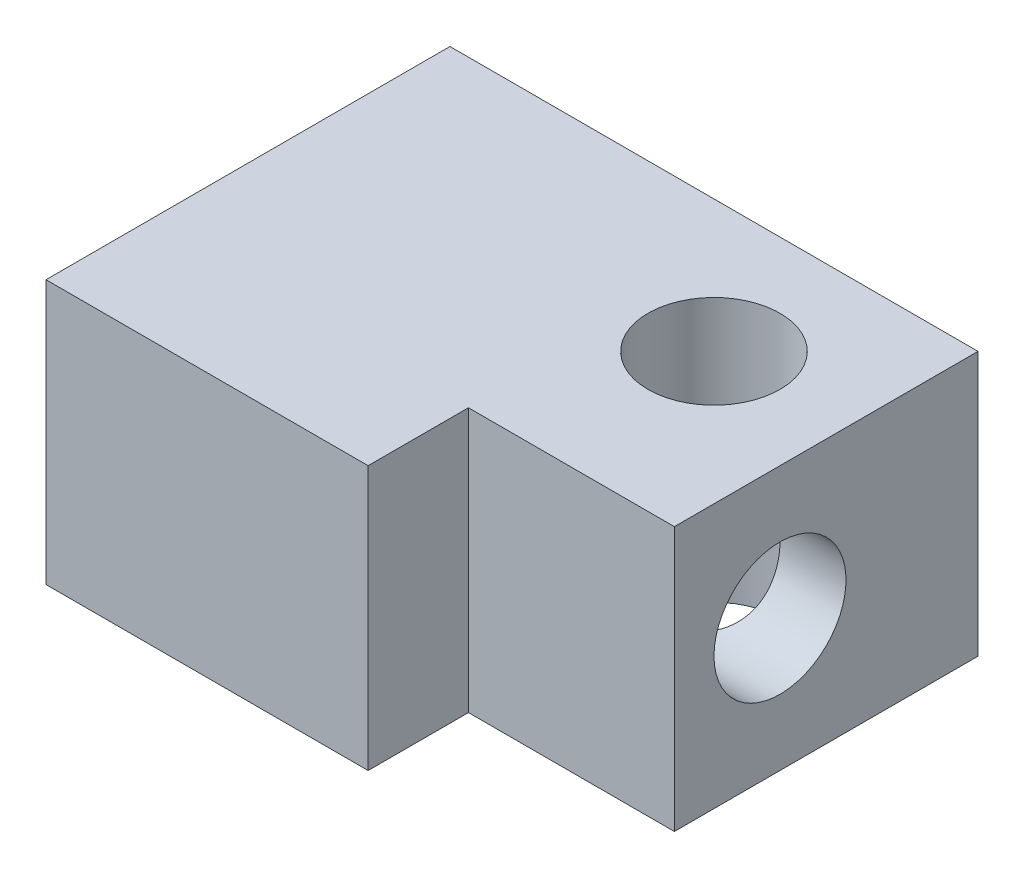
ISO-10303-21;
HEADER;
FILE_DESCRIPTION(('STEP AP214'),'2;1');
FILE_NAME('part.step','',(''),(''),'','','');
FILE_SCHEMA(('AUTOMOTIVE_DESIGN { 1 0 10303 214 1 1 1 1 }'));
ENDSEC;
DATA;
#1=APPLICATION_CONTEXT('core data for automotive mechanical design processes');
#2=APPLICATION_PROTOCOL_DEFINITION('international standard','automotive_design',2000,#1);
#3=PRODUCT_CONTEXT('',#1,'mechanical');
#4=PRODUCT('Part','Part','',(#3));
#5=PRODUCT_RELATED_PRODUCT_CATEGORY('part','',(#4));
#6=PRODUCT_DEFINITION_FORMATION('','',#4);
#7=PRODUCT_DEFINITION_CONTEXT('part definition',#1,'design');
#8=PRODUCT_DEFINITION('design','',#6,#7);
#9=PRODUCT_DEFINITION_SHAPE('','',#8);
#10=(LENGTH_UNIT() NAMED_UNIT(*) SI_UNIT(.MILLI.,.METRE.));
#11=(NAMED_UNIT(*) PLANE_ANGLE_UNIT() SI_UNIT($,.RADIAN.));
#12=(NAMED_UNIT(*) SI_UNIT($,.STERADIAN.) SOLID_ANGLE_UNIT());
#13=UNCERTAINTY_MEASURE_WITH_UNIT(LENGTH_MEASURE(1.E-05),#10,'distance_accuracy_value','');
#14=(GEOMETRIC_REPRESENTATION_CONTEXT(3) GLOBAL_UNCERTAINTY_ASSIGNED_CONTEXT((#13)) GLOBAL_UNIT_ASSIGNED_CONTEXT((#10,
#11,#12)) REPRESENTATION_CONTEXT('',''));
#15=CARTESIAN_POINT('',(0.,0.,0.));
#16=DIRECTION('',(0.,0.,1.));
#17=DIRECTION('',(1.,0.,0.));
#18=AXIS2_PLACEMENT_3D('',#15,#16,#17);
#19=CARTESIAN_POINT('',(0.,5.,8.24999999999998));
#20=DIRECTION('',(0.,0.,1.));
#21=DIRECTION('',(1.,0.,0.));
#22=AXIS2_PLACEMENT_3D('',#19,#20,#21);
#23=PLANE('',#22);
#24=DIRECTION('',(-1.,0.,0.));
#25=VECTOR('',#24,1.);
#26=CARTESIAN_POINT('',(0.,0.,8.24999999999998));
#27=LINE('',#26,#25);
#28=CARTESIAN_POINT('',(7.50000000000001,0.,8.24999999999998));
#29=VERTEX_POINT('',#28);
#30=CARTESIAN_POINT('',(3.60000000000001,0.,8.24999999999998));
#31=VERTEX_POINT('',#30);
#32=EDGE_CURVE('E127',#29,#31,#27,.T.);
#33=ORIENTED_EDGE('',*,*,#32,.F.);
#34=DIRECTION('',(0.,-1.,0.));
#35=VECTOR('',#34,1.);
#36=CARTESIAN_POINT('',(7.50000000000001,5.,8.24999999999998));
#37=LINE('',#36,#35);
#38=CARTESIAN_POINT('',(7.50000000000001,5.,8.24999999999998));
#39=VERTEX_POINT('',#38);
#40=EDGE_CURVE('E11',#39,#29,#37,.T.);
#41=ORIENTED_EDGE('',*,*,#40,.F.);
#42=DIRECTION('',(-1.,0.,0.));
#43=VECTOR('',#42,1.);
#44=CARTESIAN_POINT('',(0.,5.,8.24999999999998));
#45=LINE('',#44,#43);
#46=CARTESIAN_POINT('',(3.60000000000001,5.,8.24999999999998));
#47=VERTEX_POINT('',#46);
#48=EDGE_CURVE('E197',#39,#47,#45,.T.);
#49=ORIENTED_EDGE('',*,*,#48,.T.);
#50=DIRECTION('',(0.,-1.,0.));
#51=VECTOR('',#50,1.);
#52=CARTESIAN_POINT('',(3.60000000000001,5.,8.24999999999998));
#53=LINE('',#52,#51);
#54=EDGE_CURVE('E87',#47,#31,#53,.T.);
#55=ORIENTED_EDGE('',*,*,#54,.T.);
#56=EDGE_LOOP('',(#33,#41,#49,#55));
#57=FACE_BOUND('',#56,.T.);
#58=ADVANCED_FACE('F36',(#57),#23,.T.);
#59=CARTESIAN_POINT('',(7.50000000000001,5.,0.));
#60=DIRECTION('',(-1.,0.,0.));
#61=DIRECTION('',(0.,0.,1.));
#62=AXIS2_PLACEMENT_3D('',#59,#60,#61);
#63=PLANE('',#62);
#64=CARTESIAN_POINT('',(7.50000000000001,2.5,6.24999999999997));
#65=DIRECTION('',(-1.,0.,0.));
#66=DIRECTION('',(0.,0.,1.));
#67=AXIS2_PLACEMENT_3D('',#64,#65,#66);
#68=CIRCLE('',#67,1.25);
#69=CARTESIAN_POINT('',(7.50000000000001,2.5,7.49999999999997));
#70=VERTEX_POINT('',#69);
#71=EDGE_CURVE('E188',#70,#70,#68,.T.);
#72=ORIENTED_EDGE('',*,*,#71,.T.);
#73=EDGE_LOOP('',(#72));
#74=FACE_BOUND('',#73,.T.);
#75=DIRECTION('',(0.,0.,-1.));
#76=VECTOR('',#75,1.);
#77=CARTESIAN_POINT('',(7.50000000000001,0.,0.));
#78=LINE('',#77,#76);
#79=CARTESIAN_POINT('',(7.50000000000001,0.,2.49999999999997));
#80=VERTEX_POINT('',#79);
#81=EDGE_CURVE('E130',#29,#80,#78,.T.);
#82=ORIENTED_EDGE('',*,*,#81,.T.);
#83=DIRECTION('',(0.,-1.,0.));
#84=VECTOR('',#83,1.);
#85=CARTESIAN_POINT('',(7.50000000000001,5.,2.49999999999997));
#86=LINE('',#85,#84);
#87=CARTESIAN_POINT('',(7.50000000000001,5.,2.49999999999997));
#88=VERTEX_POINT('',#87);
#89=EDGE_CURVE('E51',#88,#80,#86,.T.);
#90=ORIENTED_EDGE('',*,*,#89,.F.);
#91=DIRECTION('',(0.,0.,-1.));
#92=VECTOR('',#91,1.);
#93=CARTESIAN_POINT('',(7.50000000000001,5.,0.));
#94=LINE('',#93,#92);
#95=EDGE_CURVE('E199',#39,#88,#94,.T.);
#96=ORIENTED_EDGE('',*,*,#95,.F.);
#97=ORIENTED_EDGE('',*,*,#40,.T.);
#98=EDGE_LOOP('',(#82,#90,#96,#97));
#99=FACE_BOUND('',#98,.T.);
#100=ADVANCED_FACE('F151',(#74,#99),#63,.F.);
#101=CARTESIAN_POINT('',(0.,5.,2.49999999999997));
#102=DIRECTION('',(0.,0.,1.));
#103=DIRECTION('',(1.,0.,0.));
#104=AXIS2_PLACEMENT_3D('',#101,#102,#103);
#105=PLANE('',#104);
#106=DIRECTION('',(-1.,0.,0.));
#107=VECTOR('',#106,1.);
#108=CARTESIAN_POINT('',(0.,0.,2.49999999999997));
#109=LINE('',#108,#107);
#110=CARTESIAN_POINT('',(-2.49999999999999,0.,2.49999999999997));
#111=VERTEX_POINT('',#110);
#112=EDGE_CURVE('E133',#80,#111,#109,.T.);
#113=ORIENTED_EDGE('',*,*,#112,.T.);
#114=DIRECTION('',(0.,-1.,0.));
#115=VECTOR('',#114,1.);
#116=CARTESIAN_POINT('',(-2.49999999999999,5.,2.49999999999997));
#117=LINE('',#116,#115);
#118=CARTESIAN_POINT('',(-2.49999999999999,5.,2.49999999999997));
#119=VERTEX_POINT('',#118);
#120=EDGE_CURVE('E117',#119,#111,#117,.T.);
#121=ORIENTED_EDGE('',*,*,#120,.F.);
#122=DIRECTION('',(-1.,0.,0.));
#123=VECTOR('',#122,1.);
#124=CARTESIAN_POINT('',(0.,5.,2.49999999999997));
#125=LINE('',#124,#123);
#126=EDGE_CURVE('E105',#88,#119,#125,.T.);
#127=ORIENTED_EDGE('',*,*,#126,.F.);
#128=ORIENTED_EDGE('',*,*,#89,.T.);
#129=EDGE_LOOP('',(#113,#121,#127,#128));
#130=FACE_BOUND('',#129,.T.);
#131=ADVANCED_FACE('F148',(#130),#105,.F.);
#132=CARTESIAN_POINT('',(-2.49999999999999,5.,0.));
#133=DIRECTION('',(1.,0.,0.));
#134=DIRECTION('',(0.,0.,-1.));
#135=AXIS2_PLACEMENT_3D('',#132,#133,#134);
#136=PLANE('',#135);
#137=CARTESIAN_POINT('',(-2.49999999999999,2.5,6.24999999999997));
#138=DIRECTION('',(-1.,0.,0.));
#139=DIRECTION('',(0.,0.,1.));
#140=AXIS2_PLACEMENT_3D('',#137,#138,#139);
#141=CIRCLE('',#140,1.25);
#142=CARTESIAN_POINT('',(-2.49999999999999,2.5,7.49999999999997));
#143=VERTEX_POINT('',#142);
#144=EDGE_CURVE('E191',#143,#143,#141,.T.);
#145=ORIENTED_EDGE('',*,*,#144,.F.);
#146=EDGE_LOOP('',(#145));
#147=FACE_BOUND('',#146,.T.);
#148=DIRECTION('',(0.,0.,1.));
#149=VECTOR('',#148,1.);
#150=CARTESIAN_POINT('',(-2.49999999999999,0.,0.));
#151=LINE('',#150,#149);
#152=CARTESIAN_POINT('',(-2.49999999999999,0.,10.15));
#153=VERTEX_POINT('',#152);
#154=EDGE_CURVE('E113',#111,#153,#151,.T.);
#155=ORIENTED_EDGE('',*,*,#154,.T.);
#156=DIRECTION('',(0.,-1.,0.));
#157=VECTOR('',#156,1.);
#158=CARTESIAN_POINT('',(-2.49999999999999,5.,10.15));
#159=LINE('',#158,#157);
#160=CARTESIAN_POINT('',(-2.49999999999999,5.,10.15));
#161=VERTEX_POINT('',#160);
#162=EDGE_CURVE('E111',#161,#153,#159,.T.);
#163=ORIENTED_EDGE('',*,*,#162,.F.);
#164=DIRECTION('',(0.,0.,1.));
#165=VECTOR('',#164,1.);
#166=CARTESIAN_POINT('',(-2.49999999999999,5.,0.));
#167=LINE('',#166,#165);
#168=EDGE_CURVE('E99',#119,#161,#167,.T.);
#169=ORIENTED_EDGE('',*,*,#168,.F.);
#170=ORIENTED_EDGE('',*,*,#120,.T.);
#171=EDGE_LOOP('',(#155,#163,#169,#170));
#172=FACE_BOUND('',#171,.T.);
#173=ADVANCED_FACE('F112',(#147,#172),#136,.F.);
#174=CARTESIAN_POINT('',(0.,5.,10.15));
#175=DIRECTION('',(0.,0.,1.));
#176=DIRECTION('',(1.,0.,0.));
#177=AXIS2_PLACEMENT_3D('',#174,#175,#176);
#178=PLANE('',#177);
#179=DIRECTION('',(-1.,0.,0.));
#180=VECTOR('',#179,1.);
#181=CARTESIAN_POINT('',(0.,0.,10.15));
#182=LINE('',#181,#180);
#183=CARTESIAN_POINT('',(3.60000000000001,0.,10.15));
#184=VERTEX_POINT('',#183);
#185=EDGE_CURVE('E137',#184,#153,#182,.T.);
#186=ORIENTED_EDGE('',*,*,#185,.F.);
#187=DIRECTION('',(0.,-1.,0.));
#188=VECTOR('',#187,1.);
#189=CARTESIAN_POINT('',(3.60000000000001,5.,10.15));
#190=LINE('',#189,#188);
#191=CARTESIAN_POINT('',(3.60000000000001,5.,10.15));
#192=VERTEX_POINT('',#191);
#193=EDGE_CURVE('E80',#192,#184,#190,.T.);
#194=ORIENTED_EDGE('',*,*,#193,.F.);
#195=DIRECTION('',(-1.,0.,0.));
#196=VECTOR('',#195,1.);
#197=CARTESIAN_POINT('',(0.,5.,10.15));
#198=LINE('',#197,#196);
#199=EDGE_CURVE('E103',#192,#161,#198,.T.);
#200=ORIENTED_EDGE('',*,*,#199,.T.);
#201=ORIENTED_EDGE('',*,*,#162,.T.);
#202=EDGE_LOOP('',(#186,#194,#200,#201));
#203=FACE_BOUND('',#202,.T.);
#204=ADVANCED_FACE('F119',(#203),#178,.T.);
#205=CARTESIAN_POINT('',(5.,5.,5.));
#206=DIRECTION('',(0.,-1.,0.));
#207=DIRECTION('',(0.,0.,-1.));
#208=AXIS2_PLACEMENT_3D('',#205,#206,#207);
#209=CYLINDRICAL_SURFACE('',#208,1.25);
#210=CARTESIAN_POINT('',(5.,3.75,6.25));
#211=CARTESIAN_POINT('',(5.06961208202377,3.7500033558061,6.24999786529754));
#212=CARTESIAN_POINT('',(5.13924791062334,3.75004170118305,6.2441686229996));
#213=CARTESIAN_POINT('',(5.27662237854133,3.74971562826647,6.22099910151578));
#214=CARTESIAN_POINT('',(5.34435947500368,3.74935089164192,6.20364972871424));
#215=CARTESIAN_POINT('',(5.47606907888645,3.74681223178614,6.15789573783841));
#216=CARTESIAN_POINT('',(5.54003676178567,3.74463604169127,6.12947729158052));
#217=CARTESIAN_POINT('',(5.66215940293159,3.73631466046054,6.06249086220682));
#218=CARTESIAN_POINT('',(5.7203164774131,3.73017092044327,6.02392659294781));
#219=CARTESIAN_POINT('',(5.82668681324461,3.71166627926565,5.93994419821133));
#220=CARTESIAN_POINT('',(5.87520075741395,3.69955884502477,5.89485446558995));
#221=CARTESIAN_POINT('',(5.9632495864012,3.6669966662719,5.79928259648899));
#222=CARTESIAN_POINT('',(6.00279908578408,3.64655566235217,5.74880943700586));
#223=CARTESIAN_POINT('',(6.06721932561986,3.59934157849853,5.65300753267082));
#224=CARTESIAN_POINT('',(6.09335519550909,3.57380872661442,5.60791341307565));
#225=CARTESIAN_POINT('',(6.13829483438517,3.51530466467927,5.51891316813244));
#226=CARTESIAN_POINT('',(6.1570984054871,3.48233325391345,5.47500707487677));
#227=CARTESIAN_POINT('',(6.18730487831171,3.41167129701446,5.39319744260718));
#228=CARTESIAN_POINT('',(6.19907334581835,3.37436469301851,5.3550935286081));
#229=CARTESIAN_POINT('',(6.21798823476215,3.29452710556955,5.28350910206602));
#230=CARTESIAN_POINT('',(6.22513314351534,3.25199441771507,5.2500301054663));
#231=CARTESIAN_POINT('',(6.23660714807492,3.15823380971364,5.18568186509502));
#232=CARTESIAN_POINT('',(6.24058751648073,3.10656192868134,5.15539897183143));
#233=CARTESIAN_POINT('',(6.24607520609984,2.99931042312482,5.10249345989318));
#234=CARTESIAN_POINT('',(6.24758118535783,2.94372869516972,5.07987500320822));
#235=CARTESIAN_POINT('',(6.24951998206867,2.82274720210582,5.04050950045167));
#236=CARTESIAN_POINT('',(6.24979511490995,2.75698867064905,5.02484986135727));
#237=CARTESIAN_POINT('',(6.25003468571998,2.62380822483299,5.00432158824104));
#238=CARTESIAN_POINT('',(6.24999907056363,2.55638602802012,4.99945479953071));
#239=CARTESIAN_POINT('',(6.25000096595674,2.41883941795823,5.00066644342973));
#240=CARTESIAN_POINT('',(6.25004156090999,2.34871853899284,5.00720574652175));
#241=CARTESIAN_POINT('',(6.24965176666125,2.21054143998916,5.03195126068147));
#242=CARTESIAN_POINT('',(6.24922119824797,2.14248601568746,5.05016190996037));
#243=CARTESIAN_POINT('',(6.2463993537575,2.01035190660502,5.09775041819891));
#244=CARTESIAN_POINT('',(6.24400625293701,1.94627698252355,5.12713865632904));
#245=CARTESIAN_POINT('',(6.23500655620218,1.82417323358958,5.19611897575222));
#246=CARTESIAN_POINT('',(6.22840163844329,1.76614201139399,5.23570698930665));
#247=CARTESIAN_POINT('',(6.20878882707751,1.66087589652269,5.32116673303867));
#248=CARTESIAN_POINT('',(6.19611750236942,1.6132463306054,5.36662544102509));
#249=CARTESIAN_POINT('',(6.16233911820246,1.52700943350312,5.46264075987772));
#250=CARTESIAN_POINT('',(6.14124596301134,1.48838739674518,5.51318886589339));
#251=CARTESIAN_POINT('',(6.09287212678173,1.42569483722977,5.6087639674287));
#252=CARTESIAN_POINT('',(6.06683986489073,1.40035405930869,5.65359524969604));
#253=CARTESIAN_POINT('',(6.00744619431329,1.35687664120274,5.7418750452139));
#254=CARTESIAN_POINT('',(5.97408421100177,1.33874056615512,5.78532344974561));
#255=CARTESIAN_POINT('',(5.90255553597077,1.30956813041756,5.86641223149011));
#256=CARTESIAN_POINT('',(5.86472187446476,1.29821607958066,5.9042360115528));
#257=CARTESIAN_POINT('',(5.78389364826442,1.28004280044354,5.97514337012988));
#258=CARTESIAN_POINT('',(5.74089737704216,1.27322307522254,6.00822537325366));
#259=CARTESIAN_POINT('',(5.64603902502818,1.26230566363697,6.0717839604545));
#260=CARTESIAN_POINT('',(5.59371991582408,1.25856219304606,6.10163780382652));
#261=CARTESIAN_POINT('',(5.48523492280654,1.2534536227878,6.15354654836428));
#262=CARTESIAN_POINT('',(5.42906697980045,1.25208980676651,6.17559723520027));
#263=CARTESIAN_POINT('',(5.3070536486503,1.25036639768356,6.21358258554129));
#264=CARTESIAN_POINT('',(5.24086664457984,1.25015061471083,6.22843432305594));
#265=CARTESIAN_POINT('',(5.10696297395127,1.24996763393156,6.24725034132602));
#266=CARTESIAN_POINT('',(5.03924606377113,1.2500004759982,6.2512128755893));
#267=CARTESIAN_POINT('',(4.90147614991496,1.2499995901791,6.24808554894825));
#268=CARTESIAN_POINT('',(4.83143237833466,1.24996327980412,6.24056908627623));
#269=CARTESIAN_POINT('',(4.69357200827069,1.25045151296892,6.21389198869108));
#270=CARTESIAN_POINT('',(4.62575629839369,1.25097627754662,6.1947267659826));
#271=CARTESIAN_POINT('',(4.49430586232631,1.25414747737534,6.14529660967648));
#272=CARTESIAN_POINT('',(4.43067251976415,1.25679461097279,6.11502802439591));
#273=CARTESIAN_POINT('',(4.30962095698285,1.26651155906021,6.04440233684305));
#274=CARTESIAN_POINT('',(4.25219972275229,1.27357921739478,6.004050158703));
#275=CARTESIAN_POINT('',(4.14851353614719,1.29426432070596,5.91748475571025));
#276=CARTESIAN_POINT('',(4.10181213616055,1.30750532176257,5.87170869591512));
#277=CARTESIAN_POINT('',(4.01745459286228,1.34249213800236,5.77536216165512));
#278=CARTESIAN_POINT('',(3.97978408264609,1.36422429808696,5.72479948324394));
#279=CARTESIAN_POINT('',(3.91881728867979,1.41373028414852,5.62952315148204));
#280=CARTESIAN_POINT('',(3.89425478023546,1.4402565576378,5.58496520478512));
#281=CARTESIAN_POINT('',(3.85220538364914,1.50052783570427,5.49742021978143));
#282=CARTESIAN_POINT('',(3.83471933846601,1.53427369955836,5.45443336918047));
#283=CARTESIAN_POINT('',(3.80655416146121,1.60666914478752,5.37406670121415));
#284=CARTESIAN_POINT('',(3.79560834217331,1.64503607956325,5.33652303953542));
#285=CARTESIAN_POINT('',(3.77815731196305,1.72686928004546,5.26629277220664));
#286=CARTESIAN_POINT('',(3.77165360568087,1.77033726775311,5.23360781523541));
#287=CARTESIAN_POINT('',(3.76127870865885,1.86630353774605,5.17085268778345));
#288=CARTESIAN_POINT('',(3.75776553020135,1.91927026078911,5.14144098370002));
#289=CARTESIAN_POINT('',(3.7530222492878,2.02898758021975,5.09055583352108));
#290=CARTESIAN_POINT('',(3.75179336712783,2.08574018230656,5.06908663530122));
#291=CARTESIAN_POINT('',(3.75027082498097,2.20876476667323,5.03251203588703));
#292=CARTESIAN_POINT('',(3.75010742545669,2.27536070660557,5.01848261086815));
#293=CARTESIAN_POINT('',(3.74997166115095,2.40994553267327,5.00140290833449));
#294=CARTESIAN_POINT('',(3.74999932535647,2.47793462860924,4.99835429686529));
#295=CARTESIAN_POINT('',(3.75000126798475,2.61588728113212,5.00340573618614));
#296=CARTESIAN_POINT('',(3.74997364732106,2.68583682330661,5.01189904599674));
#297=CARTESIAN_POINT('',(3.75057562156408,2.82334632856852,5.04050365889023));
#298=CARTESIAN_POINT('',(3.75120548335054,2.89090530978663,5.06061967828515));
#299=CARTESIAN_POINT('',(3.75475270067905,3.02163651082593,5.11187792064329));
#300=CARTESIAN_POINT('',(3.75766936548677,3.08481004900963,5.14301681256391));
#301=CARTESIAN_POINT('',(3.76813640286797,3.20477345591406,5.21526089068665));
#302=CARTESIAN_POINT('',(3.7756840866685,3.26156700623986,5.25636028544249));
#303=CARTESIAN_POINT('',(3.79746563865863,3.36364132852676,5.3439779809323));
#304=CARTESIAN_POINT('',(3.81128087138781,3.40940230321805,5.39003637390898));
#305=CARTESIAN_POINT('',(3.84747256917294,3.49186734215061,5.48664179181591));
#306=CARTESIAN_POINT('',(3.86983576585733,3.52858529867642,5.53718176740504));
#307=CARTESIAN_POINT('',(3.92045690597151,3.58784921953399,5.63211556159961));
#308=CARTESIAN_POINT('',(3.94747313546941,3.61165244808966,5.67639354292897));
#309=CARTESIAN_POINT('',(4.00861355597866,3.65231087075095,5.76319611608047));
#310=CARTESIAN_POINT('',(4.04273869016781,3.66916514201501,5.80572047434196));
#311=CARTESIAN_POINT('',(4.116001743736,3.69634915173572,5.88536410280019));
#312=CARTESIAN_POINT('',(4.15490616678283,3.70689813748654,5.9226255350776));
#313=CARTESIAN_POINT('',(4.237758568253,3.72364610948474,5.99217820135023));
#314=CARTESIAN_POINT('',(4.28170877664737,3.72984316373062,6.02446722292799));
#315=CARTESIAN_POINT('',(4.3788046406375,3.73969059486377,6.08641236836873));
#316=CARTESIAN_POINT('',(4.43242920298577,3.74298006728529,6.11537373268742));
#317=CARTESIAN_POINT('',(4.54338243790744,3.74737215732312,6.16520474779777));
#318=CARTESIAN_POINT('',(4.60071144655581,3.74847457623703,6.18607366322011));
#319=CARTESIAN_POINT('',(4.71459251779244,3.74969754606906,6.21833944589989));
#320=CARTESIAN_POINT('',(4.77101556157452,3.74986850415371,6.23019197184952));
#321=CARTESIAN_POINT('',(4.88495360603711,3.7500183520458,6.24602344419536));
#322=CARTESIAN_POINT('',(4.94246869321695,3.74999722657469,6.25000176423716));
#323=CARTESIAN_POINT('',(5.,3.75,6.25));
#324=B_SPLINE_CURVE_WITH_KNOTS('',3,(#210,#211,#212,#213,#214,#215,#216,#217,#218,#219,#220,
#221,#222,#223,#224,#225,#226,#227,#228,#229,#230,#231,#232,#233,#234,#235,#236,#237,#238,#239,
#240,#241,#242,#243,#244,#245,#246,#247,#248,#249,#250,#251,#252,#253,#254,#255,#256,#257,#258,
#259,#260,#261,#262,#263,#264,#265,#266,#267,#268,#269,#270,#271,#272,#273,#274,#275,#276,#277,
#278,#279,#280,#281,#282,#283,#284,#285,#286,#287,#288,#289,#290,#291,#292,#293,#294,#295,#296,
#297,#298,#299,#300,#301,#302,#303,#304,#305,#306,#307,#308,#309,#310,#311,#312,#313,#314,#315,
#316,#317,#318,#319,#320,#321,#322,#323),.UNSPECIFIED.,.T.,.F.,(4,2,2,2,2,2,2,2,2,2,2,2,2,2,2,2,
2,2,2,2,2,2,2,2,2,2,2,2,2,2,2,2,2,2,2,2,2,2,2,2,2,2,2,2,2,2,2,2,2,2,2,2,2,2,2,2,4),(0.,
0.208635853058989,0.417436592556166,0.626499020055713,0.835485026919864,1.03626900279049,
1.23672325150911,1.40989905564517,1.58307953314628,1.74622940236773,1.9094326221783,
2.08879044033089,2.26824549897724,2.47013348722587,2.67205599068609,2.88232735327899,
3.0926787223127,3.30322589602163,3.5136892317319,3.71363214752706,3.91324631771993,
4.08543282663773,4.25763283920862,4.42102516331619,4.58447164708461,4.76481230506924,
4.94525021334123,5.14783584231473,5.35045396159619,5.56078743163861,5.77120379400175,
5.98168942040358,6.19207246030314,6.39103309312869,6.58967507471363,6.76090552970108,
6.9321563759161,7.09583847723662,7.25957599378239,7.44090954126659,7.62233993130795,
7.82559178979605,8.02887448503357,8.2392599314141,8.44973080890383,8.66013813764086,
8.87042341917874,9.06836080425885,9.26599218535641,9.43631189364918,9.6066542136102,
9.77066437891945,9.93474730914128,10.1171215855154,10.2995124305504,10.4719270207556,
10.6443553251436),.UNSPECIFIED.);
#325=CARTESIAN_POINT('',(5.,3.75,6.25));
#326=VERTEX_POINT('',#325);
#327=EDGE_CURVE('E41',#326,#326,#324,.T.);
#328=ORIENTED_EDGE('',*,*,#327,.F.);
#329=EDGE_LOOP('',(#328));
#330=FACE_BOUND('',#329,.T.);
#331=CARTESIAN_POINT('',(5.,5.,5.));
#332=DIRECTION('',(0.,1.,0.));
#333=DIRECTION('',(0.,0.,1.));
#334=AXIS2_PLACEMENT_3D('',#331,#332,#333);
#335=CIRCLE('',#334,1.25);
#336=CARTESIAN_POINT('',(5.,5.,6.25));
#337=VERTEX_POINT('',#336);
#338=EDGE_CURVE('E141',#337,#337,#335,.T.);
#339=ORIENTED_EDGE('',*,*,#338,.T.);
#340=EDGE_LOOP('',(#339));
#341=FACE_BOUND('',#340,.T.);
#342=CARTESIAN_POINT('',(5.,0.,5.));
#343=DIRECTION('',(0.,1.,0.));
#344=DIRECTION('',(0.,0.,1.));
#345=AXIS2_PLACEMENT_3D('',#342,#343,#344);
#346=CIRCLE('',#345,1.25);
#347=CARTESIAN_POINT('',(5.,0.,6.25));
#348=VERTEX_POINT('',#347);
#349=EDGE_CURVE('E124',#348,#348,#346,.T.);
#350=ORIENTED_EDGE('',*,*,#349,.F.);
#351=EDGE_LOOP('',(#350));
#352=FACE_BOUND('',#351,.T.);
#353=ADVANCED_FACE('F38',(#330,#341,#352),#209,.F.);
#354=CARTESIAN_POINT('',(3.60000000000001,5.,0.));
#355=DIRECTION('',(-1.,0.,0.));
#356=DIRECTION('',(0.,0.,1.));
#357=AXIS2_PLACEMENT_3D('',#354,#355,#356);
#358=PLANE('',#357);
#359=DIRECTION('',(0.,0.,-1.));
#360=VECTOR('',#359,1.);
#361=CARTESIAN_POINT('',(3.60000000000001,0.,0.));
#362=LINE('',#361,#360);
#363=EDGE_CURVE('E139',#184,#31,#362,.T.);
#364=ORIENTED_EDGE('',*,*,#363,.T.);
#365=ORIENTED_EDGE('',*,*,#54,.F.);
#366=DIRECTION('',(0.,0.,-1.));
#367=VECTOR('',#366,1.);
#368=CARTESIAN_POINT('',(3.60000000000001,5.,0.));
#369=LINE('',#368,#367);
#370=EDGE_CURVE('E59',#192,#47,#369,.T.);
#371=ORIENTED_EDGE('',*,*,#370,.F.);
#372=ORIENTED_EDGE('',*,*,#193,.T.);
#373=EDGE_LOOP('',(#364,#365,#371,#372));
#374=FACE_BOUND('',#373,.T.);
#375=ADVANCED_FACE('F168',(#374),#358,.F.);
#376=CARTESIAN_POINT('',(0.,5.,0.));
#377=DIRECTION('',(0.,1.,0.));
#378=DIRECTION('',(0.,0.,1.));
#379=AXIS2_PLACEMENT_3D('',#376,#377,#378);
#380=PLANE('',#379);
#381=ORIENTED_EDGE('',*,*,#338,.F.);
#382=EDGE_LOOP('',(#381));
#383=FACE_BOUND('',#382,.T.);
#384=ORIENTED_EDGE('',*,*,#48,.F.);
#385=ORIENTED_EDGE('',*,*,#95,.T.);
#386=ORIENTED_EDGE('',*,*,#126,.T.);
#387=ORIENTED_EDGE('',*,*,#168,.T.);
#388=ORIENTED_EDGE('',*,*,#199,.F.);
#389=ORIENTED_EDGE('',*,*,#370,.T.);
#390=EDGE_LOOP('',(#384,#385,#386,#387,#388,#389));
#391=FACE_BOUND('',#390,.T.);
#392=ADVANCED_FACE('F101',(#383,#391),#380,.T.);
#393=CARTESIAN_POINT('',(0.,0.,0.));
#394=DIRECTION('',(0.,1.,0.));
#395=DIRECTION('',(0.,0.,1.));
#396=AXIS2_PLACEMENT_3D('',#393,#394,#395);
#397=PLANE('',#396);
#398=ORIENTED_EDGE('',*,*,#349,.T.);
#399=EDGE_LOOP('',(#398));
#400=FACE_BOUND('',#399,.T.);
#401=ORIENTED_EDGE('',*,*,#32,.T.);
#402=ORIENTED_EDGE('',*,*,#363,.F.);
#403=ORIENTED_EDGE('',*,*,#185,.T.);
#404=ORIENTED_EDGE('',*,*,#154,.F.);
#405=ORIENTED_EDGE('',*,*,#112,.F.);
#406=ORIENTED_EDGE('',*,*,#81,.F.);
#407=EDGE_LOOP('',(#401,#402,#403,#404,#405,#406));
#408=FACE_BOUND('',#407,.T.);
#409=ADVANCED_FACE('F153',(#400,#408),#397,.F.);
#410=CARTESIAN_POINT('',(7.50000000000001,2.5,6.24999999999997));
#411=DIRECTION('',(-1.,0.,0.));
#412=DIRECTION('',(0.,0.,1.));
#413=AXIS2_PLACEMENT_3D('',#410,#411,#412);
#414=CYLINDRICAL_SURFACE('',#413,1.25);
#415=ORIENTED_EDGE('',*,*,#327,.T.);
#416=EDGE_LOOP('',(#415));
#417=FACE_BOUND('',#416,.T.);
#418=ORIENTED_EDGE('',*,*,#71,.F.);
#419=EDGE_LOOP('',(#418));
#420=FACE_BOUND('',#419,.T.);
#421=ORIENTED_EDGE('',*,*,#144,.T.);
#422=EDGE_LOOP('',(#421));
#423=FACE_BOUND('',#422,.T.);
#424=ADVANCED_FACE('F173',(#417,#420,#423),#414,.F.);
#425=CLOSED_SHELL('',(#58,#100,#131,#173,#204,#353,#375,#392,#409,#424));
#426=MANIFOLD_SOLID_BREP('B2',#425);
#427=ADVANCED_BREP_SHAPE_REPRESENTATION('',(#18,#426),#14);
#428=SHAPE_DEFINITION_REPRESENTATION(#9,#427);
ENDSEC;
END-ISO-10303-21;
